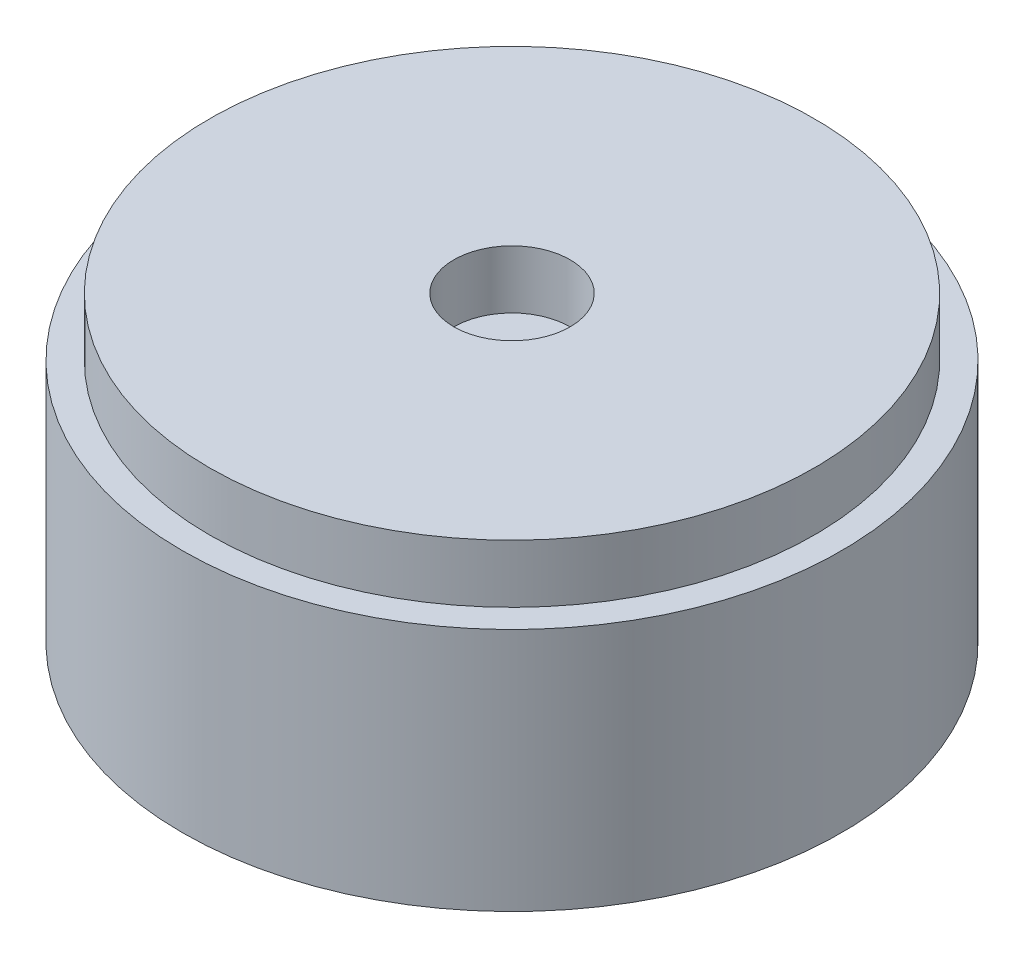
ISO-10303-21;
HEADER;
FILE_DESCRIPTION(('STEP AP214'),'2;1');
FILE_NAME('part.step','',(''),(''),'','','');
FILE_SCHEMA(('AUTOMOTIVE_DESIGN { 1 0 10303 214 1 1 1 1 }'));
ENDSEC;
DATA;
#1=APPLICATION_CONTEXT('core data for automotive mechanical design processes');
#2=APPLICATION_PROTOCOL_DEFINITION('international standard','automotive_design',2000,#1);
#3=PRODUCT_CONTEXT('',#1,'mechanical');
#4=PRODUCT('Part','Part','',(#3));
#5=PRODUCT_RELATED_PRODUCT_CATEGORY('part','',(#4));
#6=PRODUCT_DEFINITION_FORMATION('','',#4);
#7=PRODUCT_DEFINITION_CONTEXT('part definition',#1,'design');
#8=PRODUCT_DEFINITION('design','',#6,#7);
#9=PRODUCT_DEFINITION_SHAPE('','',#8);
#10=(LENGTH_UNIT() NAMED_UNIT(*) SI_UNIT(.MILLI.,.METRE.));
#11=(NAMED_UNIT(*) PLANE_ANGLE_UNIT() SI_UNIT($,.RADIAN.));
#12=(NAMED_UNIT(*) SI_UNIT($,.STERADIAN.) SOLID_ANGLE_UNIT());
#13=UNCERTAINTY_MEASURE_WITH_UNIT(LENGTH_MEASURE(1.E-05),#10,'distance_accuracy_value','');
#14=(GEOMETRIC_REPRESENTATION_CONTEXT(3) GLOBAL_UNCERTAINTY_ASSIGNED_CONTEXT((#13)) GLOBAL_UNIT_ASSIGNED_CONTEXT((#10,
#11,#12)) REPRESENTATION_CONTEXT('',''));
#15=CARTESIAN_POINT('',(0.,0.,0.));
#16=DIRECTION('',(0.,0.,1.));
#17=DIRECTION('',(1.,0.,0.));
#18=AXIS2_PLACEMENT_3D('',#15,#16,#17);
#19=CARTESIAN_POINT('',(0.,7.8,0.));
#20=DIRECTION('',(0.,1.,0.));
#21=DIRECTION('',(0.,0.,1.));
#22=AXIS2_PLACEMENT_3D('',#19,#20,#21);
#23=PLANE('',#22);
#24=CARTESIAN_POINT('',(0.,7.8,0.));
#25=DIRECTION('',(0.,1.,0.));
#26=DIRECTION('',(0.,0.,1.));
#27=AXIS2_PLACEMENT_3D('',#24,#25,#26);
#28=CIRCLE('',#27,1.5);
#29=CARTESIAN_POINT('',(0.,7.8,1.5));
#30=VERTEX_POINT('',#29);
#31=EDGE_CURVE('E74',#30,#30,#28,.T.);
#32=ORIENTED_EDGE('',*,*,#31,.F.);
#33=EDGE_LOOP('',(#32));
#34=FACE_BOUND('',#33,.T.);
#35=CARTESIAN_POINT('',(0.,7.8,0.));
#36=DIRECTION('',(0.,1.,0.));
#37=DIRECTION('',(0.,0.,1.));
#38=AXIS2_PLACEMENT_3D('',#35,#36,#37);
#39=CIRCLE('',#38,7.8);
#40=CARTESIAN_POINT('',(0.,7.8,7.8));
#41=VERTEX_POINT('',#40);
#42=EDGE_CURVE('E80',#41,#41,#39,.T.);
#43=ORIENTED_EDGE('',*,*,#42,.T.);
#44=EDGE_LOOP('',(#43));
#45=FACE_BOUND('',#44,.T.);
#46=ADVANCED_FACE('F38',(#34,#45),#23,.T.);
#47=CARTESIAN_POINT('',(0.,6.3,0.));
#48=DIRECTION('',(0.,1.,0.));
#49=DIRECTION('',(0.,0.,1.));
#50=AXIS2_PLACEMENT_3D('',#47,#48,#49);
#51=CYLINDRICAL_SURFACE('',#50,1.5);
#52=CARTESIAN_POINT('',(0.,6.3,0.));
#53=DIRECTION('',(0.,1.,0.));
#54=DIRECTION('',(0.,0.,1.));
#55=AXIS2_PLACEMENT_3D('',#52,#53,#54);
#56=CIRCLE('',#55,1.5);
#57=CARTESIAN_POINT('',(0.,6.3,1.5));
#58=VERTEX_POINT('',#57);
#59=EDGE_CURVE('E73',#58,#58,#56,.T.);
#60=ORIENTED_EDGE('',*,*,#59,.F.);
#61=EDGE_LOOP('',(#60));
#62=FACE_BOUND('',#61,.T.);
#63=ORIENTED_EDGE('',*,*,#31,.T.);
#64=EDGE_LOOP('',(#63));
#65=FACE_BOUND('',#64,.T.);
#66=ADVANCED_FACE('F115',(#62,#65),#51,.F.);
#67=CARTESIAN_POINT('',(0.,6.3,0.));
#68=DIRECTION('',(0.,1.,0.));
#69=DIRECTION('',(0.,0.,1.));
#70=AXIS2_PLACEMENT_3D('',#67,#68,#69);
#71=PLANE('',#70);
#72=ORIENTED_EDGE('',*,*,#59,.T.);
#73=EDGE_LOOP('',(#72));
#74=FACE_BOUND('',#73,.T.);
#75=ADVANCED_FACE('F121',(#74),#71,.T.);
#76=CARTESIAN_POINT('',(0.,6.3,0.));
#77=DIRECTION('',(0.,1.,0.));
#78=DIRECTION('',(0.,0.,1.));
#79=AXIS2_PLACEMENT_3D('',#76,#77,#78);
#80=CYLINDRICAL_SURFACE('',#79,7.8);
#81=CARTESIAN_POINT('',(0.,6.3,0.));
#82=DIRECTION('',(0.,1.,0.));
#83=DIRECTION('',(0.,0.,1.));
#84=AXIS2_PLACEMENT_3D('',#81,#82,#83);
#85=CIRCLE('',#84,7.8);
#86=CARTESIAN_POINT('',(0.,6.3,7.8));
#87=VERTEX_POINT('',#86);
#88=EDGE_CURVE('E83',#87,#87,#85,.T.);
#89=ORIENTED_EDGE('',*,*,#88,.T.);
#90=EDGE_LOOP('',(#89));
#91=FACE_BOUND('',#90,.T.);
#92=ORIENTED_EDGE('',*,*,#42,.F.);
#93=EDGE_LOOP('',(#92));
#94=FACE_BOUND('',#93,.T.);
#95=ADVANCED_FACE('F89',(#91,#94),#80,.T.);
#96=CARTESIAN_POINT('',(0.,6.3,0.));
#97=DIRECTION('',(0.,1.,0.));
#98=DIRECTION('',(0.,0.,1.));
#99=AXIS2_PLACEMENT_3D('',#96,#97,#98);
#100=PLANE('',#99);
#101=ORIENTED_EDGE('',*,*,#88,.F.);
#102=EDGE_LOOP('',(#101));
#103=FACE_BOUND('',#102,.T.);
#104=CARTESIAN_POINT('',(0.,6.3,0.));
#105=DIRECTION('',(0.,1.,0.));
#106=DIRECTION('',(0.,0.,1.));
#107=AXIS2_PLACEMENT_3D('',#104,#105,#106);
#108=CIRCLE('',#107,8.5);
#109=CARTESIAN_POINT('',(0.,6.3,8.5));
#110=VERTEX_POINT('',#109);
#111=EDGE_CURVE('E77',#110,#110,#108,.T.);
#112=ORIENTED_EDGE('',*,*,#111,.T.);
#113=EDGE_LOOP('',(#112));
#114=FACE_BOUND('',#113,.T.);
#115=ADVANCED_FACE('F92',(#103,#114),#100,.T.);
#116=CARTESIAN_POINT('',(0.,0.,0.));
#117=DIRECTION('',(0.,1.,0.));
#118=DIRECTION('',(0.,0.,1.));
#119=AXIS2_PLACEMENT_3D('',#116,#117,#118);
#120=PLANE('',#119);
#121=CARTESIAN_POINT('',(5.,0.,-5.));
#122=DIRECTION('',(0.,1.,0.));
#123=DIRECTION('',(0.,0.,1.));
#124=AXIS2_PLACEMENT_3D('',#121,#122,#123);
#125=CIRCLE('',#124,0.500000000000001);
#126=CARTESIAN_POINT('',(5.,0.,-4.5));
#127=VERTEX_POINT('',#126);
#128=EDGE_CURVE('E64',#127,#127,#125,.F.);
#129=ORIENTED_EDGE('',*,*,#128,.F.);
#130=EDGE_LOOP('',(#129));
#131=FACE_BOUND('',#130,.T.);
#132=CARTESIAN_POINT('',(-5.,0.,5.));
#133=DIRECTION('',(0.,1.,0.));
#134=DIRECTION('',(0.,0.,1.));
#135=AXIS2_PLACEMENT_3D('',#132,#133,#134);
#136=CIRCLE('',#135,0.5);
#137=CARTESIAN_POINT('',(-5.,0.,5.5));
#138=VERTEX_POINT('',#137);
#139=EDGE_CURVE('E67',#138,#138,#136,.F.);
#140=ORIENTED_EDGE('',*,*,#139,.F.);
#141=EDGE_LOOP('',(#140));
#142=FACE_BOUND('',#141,.T.);
#143=CARTESIAN_POINT('',(0.,0.,0.));
#144=DIRECTION('',(0.,1.,0.));
#145=DIRECTION('',(0.,0.,1.));
#146=AXIS2_PLACEMENT_3D('',#143,#144,#145);
#147=CIRCLE('',#146,8.5);
#148=CARTESIAN_POINT('',(0.,0.,8.5));
#149=VERTEX_POINT('',#148);
#150=EDGE_CURVE('E70',#149,#149,#147,.T.);
#151=ORIENTED_EDGE('',*,*,#150,.F.);
#152=EDGE_LOOP('',(#151));
#153=FACE_BOUND('',#152,.T.);
#154=ADVANCED_FACE('F95',(#131,#142,#153),#120,.F.);
#155=CARTESIAN_POINT('',(0.,7.8,0.));
#156=DIRECTION('',(0.,-1.,0.));
#157=DIRECTION('',(0.,0.,-1.));
#158=AXIS2_PLACEMENT_3D('',#155,#156,#157);
#159=CYLINDRICAL_SURFACE('',#158,8.5);
#160=ORIENTED_EDGE('',*,*,#150,.T.);
#161=EDGE_LOOP('',(#160));
#162=FACE_BOUND('',#161,.T.);
#163=ORIENTED_EDGE('',*,*,#111,.F.);
#164=EDGE_LOOP('',(#163));
#165=FACE_BOUND('',#164,.T.);
#166=ADVANCED_FACE('F99',(#162,#165),#159,.T.);
#167=CARTESIAN_POINT('',(-5.,-2.,5.));
#168=DIRECTION('',(0.,1.,0.));
#169=DIRECTION('',(0.,0.,1.));
#170=AXIS2_PLACEMENT_3D('',#167,#168,#169);
#171=CYLINDRICAL_SURFACE('',#170,0.5);
#172=CARTESIAN_POINT('',(-5.,-1.40098048640719,5.));
#173=DIRECTION('',(0.,-1.,0.));
#174=DIRECTION('',(0.,0.,-1.));
#175=AXIS2_PLACEMENT_3D('',#172,#173,#174);
#176=CIRCLE('',#175,0.5);
#177=CARTESIAN_POINT('',(-5.,-1.40098048640719,4.5));
#178=VERTEX_POINT('',#177);
#179=EDGE_CURVE('E53',#178,#178,#176,.F.);
#180=ORIENTED_EDGE('',*,*,#179,.T.);
#181=EDGE_LOOP('',(#180));
#182=FACE_BOUND('',#181,.T.);
#183=ORIENTED_EDGE('',*,*,#139,.T.);
#184=EDGE_LOOP('',(#183));
#185=FACE_BOUND('',#184,.T.);
#186=ADVANCED_FACE('F101',(#182,#185),#171,.T.);
#187=CARTESIAN_POINT('',(-5.,-2.,5.));
#188=DIRECTION('',(0.,-1.,0.));
#189=DIRECTION('',(0.,0.,-1.));
#190=AXIS2_PLACEMENT_3D('',#187,#188,#189);
#191=PLANE('',#190);
#192=CARTESIAN_POINT('',(-5.,-2.,5.));
#193=DIRECTION('',(0.,-1.,0.));
#194=DIRECTION('',(0.,0.,-1.));
#195=AXIS2_PLACEMENT_3D('',#192,#193,#194);
#196=CIRCLE('',#195,0.399999999999995);
#197=CARTESIAN_POINT('',(-5.,-2.,4.6));
#198=VERTEX_POINT('',#197);
#199=EDGE_CURVE('E61',#198,#198,#196,.T.);
#200=ORIENTED_EDGE('',*,*,#199,.T.);
#201=EDGE_LOOP('',(#200));
#202=FACE_BOUND('',#201,.T.);
#203=ADVANCED_FACE('F108',(#202),#191,.T.);
#204=CARTESIAN_POINT('',(5.,-2.,-5.));
#205=DIRECTION('',(0.,1.,0.));
#206=DIRECTION('',(0.,0.,1.));
#207=AXIS2_PLACEMENT_3D('',#204,#205,#206);
#208=CYLINDRICAL_SURFACE('',#207,0.500000000000001);
#209=CARTESIAN_POINT('',(5.,-1.40098048640718,-5.));
#210=DIRECTION('',(0.,-1.,0.));
#211=DIRECTION('',(0.,0.,-1.));
#212=AXIS2_PLACEMENT_3D('',#209,#210,#211);
#213=CIRCLE('',#212,0.500000000000001);
#214=CARTESIAN_POINT('',(5.,-1.40098048640718,-5.5));
#215=VERTEX_POINT('',#214);
#216=EDGE_CURVE('E45',#215,#215,#213,.F.);
#217=ORIENTED_EDGE('',*,*,#216,.T.);
#218=EDGE_LOOP('',(#217));
#219=FACE_BOUND('',#218,.T.);
#220=ORIENTED_EDGE('',*,*,#128,.T.);
#221=EDGE_LOOP('',(#220));
#222=FACE_BOUND('',#221,.T.);
#223=ADVANCED_FACE('F134',(#219,#222),#208,.T.);
#224=CARTESIAN_POINT('',(5.,-2.,-5.));
#225=DIRECTION('',(0.,-1.,0.));
#226=DIRECTION('',(0.,0.,-1.));
#227=AXIS2_PLACEMENT_3D('',#224,#225,#226);
#228=PLANE('',#227);
#229=CARTESIAN_POINT('',(5.,-2.,-5.));
#230=DIRECTION('',(0.,-1.,0.));
#231=DIRECTION('',(0.,0.,-1.));
#232=AXIS2_PLACEMENT_3D('',#229,#230,#231);
#233=CIRCLE('',#232,0.399999999999996);
#234=CARTESIAN_POINT('',(5.,-2.,-5.4));
#235=VERTEX_POINT('',#234);
#236=EDGE_CURVE('E58',#235,#235,#233,.T.);
#237=ORIENTED_EDGE('',*,*,#236,.T.);
#238=EDGE_LOOP('',(#237));
#239=FACE_BOUND('',#238,.T.);
#240=ADVANCED_FACE('F138',(#239),#228,.T.);
#241=CARTESIAN_POINT('',(-5.,-2.,5.));
#242=DIRECTION('',(0.,1.,0.));
#243=DIRECTION('',(0.,0.,1.));
#244=AXIS2_PLACEMENT_3D('',#241,#242,#243);
#245=CONICAL_SURFACE('',#244,0.399999999999995,0.197395559849878);
#246=CARTESIAN_POINT('',(-5.,-1.59709662154537,5.));
#247=DIRECTION('',(0.,1.,0.));
#248=DIRECTION('',(0.,0.,1.));
#249=AXIS2_PLACEMENT_3D('',#246,#247,#248);
#250=CIRCLE('',#249,0.48058067569092);
#251=CARTESIAN_POINT('',(-5.,-1.59709662154537,5.48058067569092));
#252=VERTEX_POINT('',#251);
#253=EDGE_CURVE('E49',#252,#252,#250,.F.);
#254=ORIENTED_EDGE('',*,*,#253,.T.);
#255=EDGE_LOOP('',(#254));
#256=FACE_BOUND('',#255,.T.);
#257=ORIENTED_EDGE('',*,*,#199,.F.);
#258=EDGE_LOOP('',(#257));
#259=FACE_BOUND('',#258,.T.);
#260=ADVANCED_FACE('F140',(#256,#259),#245,.T.);
#261=CARTESIAN_POINT('',(5.,-2.,-5.));
#262=DIRECTION('',(0.,1.,0.));
#263=DIRECTION('',(0.,0.,1.));
#264=AXIS2_PLACEMENT_3D('',#261,#262,#263);
#265=CONICAL_SURFACE('',#264,0.399999999999996,0.197395559849876);
#266=CARTESIAN_POINT('',(5.,-1.59709662154536,-5.));
#267=DIRECTION('',(0.,1.,0.));
#268=DIRECTION('',(0.,0.,1.));
#269=AXIS2_PLACEMENT_3D('',#266,#267,#268);
#270=CIRCLE('',#269,0.480580675690922);
#271=CARTESIAN_POINT('',(5.,-1.59709662154536,-4.51941932430908));
#272=VERTEX_POINT('',#271);
#273=EDGE_CURVE('E11',#272,#272,#270,.F.);
#274=ORIENTED_EDGE('',*,*,#273,.T.);
#275=EDGE_LOOP('',(#274));
#276=FACE_BOUND('',#275,.T.);
#277=ORIENTED_EDGE('',*,*,#236,.F.);
#278=EDGE_LOOP('',(#277));
#279=FACE_BOUND('',#278,.T.);
#280=ADVANCED_FACE('F145',(#276,#279),#265,.T.);
#281=CARTESIAN_POINT('',(-5.,-1.40098048640719,5.));
#282=DIRECTION('',(0.,-1.,0.));
#283=DIRECTION('',(0.,0.,-1.));
#284=AXIS2_PLACEMENT_3D('',#281,#282,#283);
#285=DEGENERATE_TOROIDAL_SURFACE('',#284,0.5,1.,.F.);
#286=ORIENTED_EDGE('',*,*,#253,.F.);
#287=EDGE_LOOP('',(#286));
#288=FACE_BOUND('',#287,.T.);
#289=ORIENTED_EDGE('',*,*,#179,.F.);
#290=EDGE_LOOP('',(#289));
#291=FACE_BOUND('',#290,.T.);
#292=ADVANCED_FACE('F150',(#288,#291),#285,.F.);
#293=CARTESIAN_POINT('',(5.,-1.40098048640718,-5.));
#294=DIRECTION('',(0.,-1.,0.));
#295=DIRECTION('',(0.,0.,-1.));
#296=AXIS2_PLACEMENT_3D('',#293,#294,#295);
#297=DEGENERATE_TOROIDAL_SURFACE('',#296,0.499999999999999,1.,.F.);
#298=ORIENTED_EDGE('',*,*,#273,.F.);
#299=EDGE_LOOP('',(#298));
#300=FACE_BOUND('',#299,.T.);
#301=ORIENTED_EDGE('',*,*,#216,.F.);
#302=EDGE_LOOP('',(#301));
#303=FACE_BOUND('',#302,.T.);
#304=ADVANCED_FACE('F40',(#300,#303),#297,.F.);
#305=CLOSED_SHELL('',(#46,#66,#75,#95,#115,#154,#166,#186,#203,#223,#240,#260,#280,#292,#304));
#306=MANIFOLD_SOLID_BREP('B2',#305);
#307=ADVANCED_BREP_SHAPE_REPRESENTATION('',(#18,#306),#14);
#308=SHAPE_DEFINITION_REPRESENTATION(#9,#307);
ENDSEC;
END-ISO-10303-21;
